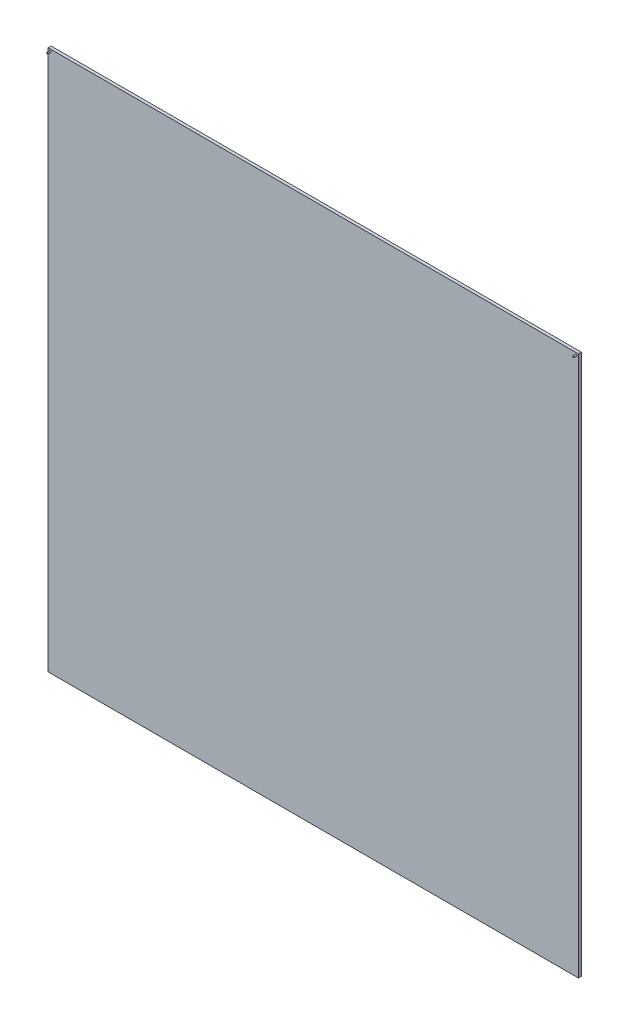
ISO-10303-21;
HEADER;
FILE_DESCRIPTION(('STEP AP214'),'2;1');
FILE_NAME('part.step','',(''),(''),'','','');
FILE_SCHEMA(('AUTOMOTIVE_DESIGN { 1 0 10303 214 1 1 1 1 }'));
ENDSEC;
DATA;
#1=APPLICATION_CONTEXT('core data for automotive mechanical design processes');
#2=APPLICATION_PROTOCOL_DEFINITION('international standard','automotive_design',2000,#1);
#3=PRODUCT_CONTEXT('',#1,'mechanical');
#4=PRODUCT('Part','Part','',(#3));
#5=PRODUCT_RELATED_PRODUCT_CATEGORY('part','',(#4));
#6=PRODUCT_DEFINITION_FORMATION('','',#4);
#7=PRODUCT_DEFINITION_CONTEXT('part definition',#1,'design');
#8=PRODUCT_DEFINITION('design','',#6,#7);
#9=PRODUCT_DEFINITION_SHAPE('','',#8);
#10=(LENGTH_UNIT() NAMED_UNIT(*) SI_UNIT(.MILLI.,.METRE.));
#11=(NAMED_UNIT(*) PLANE_ANGLE_UNIT() SI_UNIT($,.RADIAN.));
#12=(NAMED_UNIT(*) SI_UNIT($,.STERADIAN.) SOLID_ANGLE_UNIT());
#13=UNCERTAINTY_MEASURE_WITH_UNIT(LENGTH_MEASURE(1.E-05),#10,'distance_accuracy_value','');
#14=(GEOMETRIC_REPRESENTATION_CONTEXT(3) GLOBAL_UNCERTAINTY_ASSIGNED_CONTEXT((#13)) GLOBAL_UNIT_ASSIGNED_CONTEXT((#10,
#11,#12)) REPRESENTATION_CONTEXT('',''));
#15=CARTESIAN_POINT('',(0.,0.,0.));
#16=DIRECTION('',(0.,0.,1.));
#17=DIRECTION('',(1.,0.,0.));
#18=AXIS2_PLACEMENT_3D('',#15,#16,#17);
#19=CARTESIAN_POINT('',(0.,0.,10.));
#20=DIRECTION('',(0.,0.,1.));
#21=DIRECTION('',(1.,0.,0.));
#22=AXIS2_PLACEMENT_3D('',#19,#20,#21);
#23=PLANE('',#22);
#24=CARTESIAN_POINT('',(-7.50000000000021,1775.266953,10.));
#25=DIRECTION('',(0.,0.,1.));
#26=DIRECTION('',(1.,0.,0.));
#27=AXIS2_PLACEMENT_3D('',#24,#25,#26);
#28=CIRCLE('',#27,2.50000000000022);
#29=CARTESIAN_POINT('',(-4.99999999999999,1775.266953,10.));
#30=VERTEX_POINT('',#29);
#31=EDGE_CURVE('E111',#30,#30,#28,.T.);
#32=ORIENTED_EDGE('',*,*,#31,.F.);
#33=EDGE_LOOP('',(#32));
#34=FACE_BOUND('',#33,.T.);
#35=DIRECTION('',(0.,-1.,0.));
#36=VECTOR('',#35,1.);
#37=CARTESIAN_POINT('',(-15.,1782.766953,10.));
#38=LINE('',#37,#36);
#39=CARTESIAN_POINT('',(-15.,1782.766953,10.));
#40=VERTEX_POINT('',#39);
#41=CARTESIAN_POINT('',(-14.9999999999998,-50.,10.));
#42=VERTEX_POINT('',#41);
#43=EDGE_CURVE('E85',#40,#42,#38,.T.);
#44=ORIENTED_EDGE('',*,*,#43,.T.);
#45=DIRECTION('',(1.,0.,0.));
#46=VECTOR('',#45,1.);
#47=CARTESIAN_POINT('',(-14.9999999999998,-50.,10.));
#48=LINE('',#47,#46);
#49=CARTESIAN_POINT('',(1782.766953,-50.,10.));
#50=VERTEX_POINT('',#49);
#51=EDGE_CURVE('E80',#42,#50,#48,.T.);
#52=ORIENTED_EDGE('',*,*,#51,.T.);
#53=DIRECTION('',(0.,1.,0.));
#54=VECTOR('',#53,1.);
#55=CARTESIAN_POINT('',(1782.766953,1782.766953,10.));
#56=LINE('',#55,#54);
#57=CARTESIAN_POINT('',(1782.766953,1782.766953,10.));
#58=VERTEX_POINT('',#57);
#59=EDGE_CURVE('E83',#50,#58,#56,.T.);
#60=ORIENTED_EDGE('',*,*,#59,.T.);
#61=DIRECTION('',(-1.,0.,0.));
#62=VECTOR('',#61,1.);
#63=CARTESIAN_POINT('',(-15.,1782.766953,10.));
#64=LINE('',#63,#62);
#65=EDGE_CURVE('E50',#58,#40,#64,.T.);
#66=ORIENTED_EDGE('',*,*,#65,.T.);
#67=EDGE_LOOP('',(#44,#52,#60,#66));
#68=FACE_BOUND('',#67,.T.);
#69=CARTESIAN_POINT('',(1775.266953,1775.266953,10.));
#70=DIRECTION('',(0.,0.,1.));
#71=DIRECTION('',(-1.,0.,0.));
#72=AXIS2_PLACEMENT_3D('',#69,#70,#71);
#73=CIRCLE('',#72,2.50000000000059);
#74=CARTESIAN_POINT('',(1772.766953,1775.266953,10.));
#75=VERTEX_POINT('',#74);
#76=EDGE_CURVE('E117',#75,#75,#73,.T.);
#77=ORIENTED_EDGE('',*,*,#76,.F.);
#78=EDGE_LOOP('',(#77));
#79=FACE_BOUND('',#78,.T.);
#80=ADVANCED_FACE('F33',(#34,#68,#79),#23,.T.);
#81=CARTESIAN_POINT('',(-15.,1782.766953,10.));
#82=DIRECTION('',(1.,0.,0.));
#83=DIRECTION('',(0.,1.,0.));
#84=AXIS2_PLACEMENT_3D('',#81,#82,#83);
#85=PLANE('',#84);
#86=DIRECTION('',(0.,-1.,0.));
#87=VECTOR('',#86,1.);
#88=CARTESIAN_POINT('',(-15.,1782.766953,0.));
#89=LINE('',#88,#87);
#90=CARTESIAN_POINT('',(-15.,1782.766953,0.));
#91=VERTEX_POINT('',#90);
#92=CARTESIAN_POINT('',(-14.9999999999998,-50.,0.));
#93=VERTEX_POINT('',#92);
#94=EDGE_CURVE('E97',#91,#93,#89,.T.);
#95=ORIENTED_EDGE('',*,*,#94,.T.);
#96=DIRECTION('',(0.,0.,-1.));
#97=VECTOR('',#96,1.);
#98=CARTESIAN_POINT('',(-14.9999999999998,-50.,10.));
#99=LINE('',#98,#97);
#100=EDGE_CURVE('E11',#42,#93,#99,.T.);
#101=ORIENTED_EDGE('',*,*,#100,.F.);
#102=ORIENTED_EDGE('',*,*,#43,.F.);
#103=DIRECTION('',(0.,0.,-1.));
#104=VECTOR('',#103,1.);
#105=CARTESIAN_POINT('',(-15.,1782.766953,10.));
#106=LINE('',#105,#104);
#107=EDGE_CURVE('E93',#40,#91,#106,.T.);
#108=ORIENTED_EDGE('',*,*,#107,.T.);
#109=EDGE_LOOP('',(#95,#101,#102,#108));
#110=FACE_BOUND('',#109,.T.);
#111=ADVANCED_FACE('F35',(#110),#85,.F.);
#112=CARTESIAN_POINT('',(-14.9999999999998,-50.,10.));
#113=DIRECTION('',(0.,1.,0.));
#114=DIRECTION('',(-1.,0.,0.));
#115=AXIS2_PLACEMENT_3D('',#112,#113,#114);
#116=PLANE('',#115);
#117=DIRECTION('',(1.,0.,0.));
#118=VECTOR('',#117,1.);
#119=CARTESIAN_POINT('',(-14.9999999999998,-50.,0.));
#120=LINE('',#119,#118);
#121=CARTESIAN_POINT('',(1782.766953,-50.,0.));
#122=VERTEX_POINT('',#121);
#123=EDGE_CURVE('E89',#93,#122,#120,.T.);
#124=ORIENTED_EDGE('',*,*,#123,.T.);
#125=DIRECTION('',(0.,0.,-1.));
#126=VECTOR('',#125,1.);
#127=CARTESIAN_POINT('',(1782.766953,-50.,10.));
#128=LINE('',#127,#126);
#129=EDGE_CURVE('E42',#50,#122,#128,.T.);
#130=ORIENTED_EDGE('',*,*,#129,.F.);
#131=ORIENTED_EDGE('',*,*,#51,.F.);
#132=ORIENTED_EDGE('',*,*,#100,.T.);
#133=EDGE_LOOP('',(#124,#130,#131,#132));
#134=FACE_BOUND('',#133,.T.);
#135=ADVANCED_FACE('F88',(#134),#116,.F.);
#136=CARTESIAN_POINT('',(1782.766953,1782.766953,10.));
#137=DIRECTION('',(-1.,0.,0.));
#138=DIRECTION('',(0.,-1.,0.));
#139=AXIS2_PLACEMENT_3D('',#136,#137,#138);
#140=PLANE('',#139);
#141=DIRECTION('',(0.,1.,0.));
#142=VECTOR('',#141,1.);
#143=CARTESIAN_POINT('',(1782.766953,1782.766953,0.));
#144=LINE('',#143,#142);
#145=CARTESIAN_POINT('',(1782.766953,1782.766953,0.));
#146=VERTEX_POINT('',#145);
#147=EDGE_CURVE('E67',#122,#146,#144,.T.);
#148=ORIENTED_EDGE('',*,*,#147,.T.);
#149=DIRECTION('',(0.,0.,-1.));
#150=VECTOR('',#149,1.);
#151=CARTESIAN_POINT('',(1782.766953,1782.766953,10.));
#152=LINE('',#151,#150);
#153=EDGE_CURVE('E90',#58,#146,#152,.T.);
#154=ORIENTED_EDGE('',*,*,#153,.F.);
#155=ORIENTED_EDGE('',*,*,#59,.F.);
#156=ORIENTED_EDGE('',*,*,#129,.T.);
#157=EDGE_LOOP('',(#148,#154,#155,#156));
#158=FACE_BOUND('',#157,.T.);
#159=ADVANCED_FACE('F91',(#158),#140,.F.);
#160=CARTESIAN_POINT('',(-15.,1782.766953,10.));
#161=DIRECTION('',(0.,-1.,0.));
#162=DIRECTION('',(0.,0.,-1.));
#163=AXIS2_PLACEMENT_3D('',#160,#161,#162);
#164=PLANE('',#163);
#165=DIRECTION('',(-1.,0.,0.));
#166=VECTOR('',#165,1.);
#167=CARTESIAN_POINT('',(-15.,1782.766953,0.));
#168=LINE('',#167,#166);
#169=EDGE_CURVE('E73',#146,#91,#168,.T.);
#170=ORIENTED_EDGE('',*,*,#169,.T.);
#171=ORIENTED_EDGE('',*,*,#107,.F.);
#172=ORIENTED_EDGE('',*,*,#65,.F.);
#173=ORIENTED_EDGE('',*,*,#153,.T.);
#174=EDGE_LOOP('',(#170,#171,#172,#173));
#175=FACE_BOUND('',#174,.T.);
#176=ADVANCED_FACE('F105',(#175),#164,.F.);
#177=CARTESIAN_POINT('',(0.,0.,0.));
#178=DIRECTION('',(0.,0.,1.));
#179=DIRECTION('',(1.,0.,0.));
#180=AXIS2_PLACEMENT_3D('',#177,#178,#179);
#181=PLANE('',#180);
#182=ORIENTED_EDGE('',*,*,#94,.F.);
#183=ORIENTED_EDGE('',*,*,#169,.F.);
#184=ORIENTED_EDGE('',*,*,#147,.F.);
#185=ORIENTED_EDGE('',*,*,#123,.F.);
#186=EDGE_LOOP('',(#182,#183,#184,#185));
#187=FACE_BOUND('',#186,.T.);
#188=ADVANCED_FACE('F108',(#187),#181,.F.);
#189=CARTESIAN_POINT('',(-7.50000000000021,1775.266953,20.));
#190=DIRECTION('',(0.,0.,-1.));
#191=DIRECTION('',(-1.,0.,0.));
#192=AXIS2_PLACEMENT_3D('',#189,#190,#191);
#193=CYLINDRICAL_SURFACE('',#192,2.50000000000022);
#194=CARTESIAN_POINT('',(-7.50000000000021,1775.266953,20.));
#195=DIRECTION('',(0.,0.,1.));
#196=DIRECTION('',(1.,0.,0.));
#197=AXIS2_PLACEMENT_3D('',#194,#195,#196);
#198=CIRCLE('',#197,2.50000000000022);
#199=CARTESIAN_POINT('',(-4.99999999999999,1775.266953,20.));
#200=VERTEX_POINT('',#199);
#201=EDGE_CURVE('E100',#200,#200,#198,.T.);
#202=ORIENTED_EDGE('',*,*,#201,.F.);
#203=EDGE_LOOP('',(#202));
#204=FACE_BOUND('',#203,.T.);
#205=ORIENTED_EDGE('',*,*,#31,.T.);
#206=EDGE_LOOP('',(#205));
#207=FACE_BOUND('',#206,.T.);
#208=ADVANCED_FACE('F140',(#204,#207),#193,.T.);
#209=CARTESIAN_POINT('',(-7.50000000000021,1775.266953,20.));
#210=DIRECTION('',(0.,0.,1.));
#211=DIRECTION('',(1.,0.,0.));
#212=AXIS2_PLACEMENT_3D('',#209,#210,#211);
#213=PLANE('',#212);
#214=ORIENTED_EDGE('',*,*,#201,.T.);
#215=EDGE_LOOP('',(#214));
#216=FACE_BOUND('',#215,.T.);
#217=ADVANCED_FACE('F128',(#216),#213,.T.);
#218=CARTESIAN_POINT('',(1775.266953,1775.266953,20.));
#219=DIRECTION('',(0.,0.,-1.));
#220=DIRECTION('',(-1.,0.,0.));
#221=AXIS2_PLACEMENT_3D('',#218,#219,#220);
#222=CYLINDRICAL_SURFACE('',#221,2.50000000000059);
#223=CARTESIAN_POINT('',(1775.266953,1775.266953,20.));
#224=DIRECTION('',(0.,0.,1.));
#225=DIRECTION('',(-1.,0.,0.));
#226=AXIS2_PLACEMENT_3D('',#223,#224,#225);
#227=CIRCLE('',#226,2.50000000000059);
#228=CARTESIAN_POINT('',(1772.766953,1775.266953,20.));
#229=VERTEX_POINT('',#228);
#230=EDGE_CURVE('E114',#229,#229,#227,.T.);
#231=ORIENTED_EDGE('',*,*,#230,.F.);
#232=EDGE_LOOP('',(#231));
#233=FACE_BOUND('',#232,.T.);
#234=ORIENTED_EDGE('',*,*,#76,.T.);
#235=EDGE_LOOP('',(#234));
#236=FACE_BOUND('',#235,.T.);
#237=ADVANCED_FACE('F125',(#233,#236),#222,.T.);
#238=CARTESIAN_POINT('',(1775.266953,1775.266953,20.));
#239=DIRECTION('',(0.,0.,-1.));
#240=DIRECTION('',(-1.,0.,0.));
#241=AXIS2_PLACEMENT_3D('',#238,#239,#240);
#242=PLANE('',#241);
#243=ORIENTED_EDGE('',*,*,#230,.T.);
#244=EDGE_LOOP('',(#243));
#245=FACE_BOUND('',#244,.T.);
#246=ADVANCED_FACE('F123',(#245),#242,.F.);
#247=CLOSED_SHELL('',(#80,#111,#135,#159,#176,#188,#208,#217,#237,#246));
#248=MANIFOLD_SOLID_BREP('B2',#247);
#249=ADVANCED_BREP_SHAPE_REPRESENTATION('',(#18,#248),#14);
#250=SHAPE_DEFINITION_REPRESENTATION(#9,#249);
ENDSEC;
END-ISO-10303-21;
